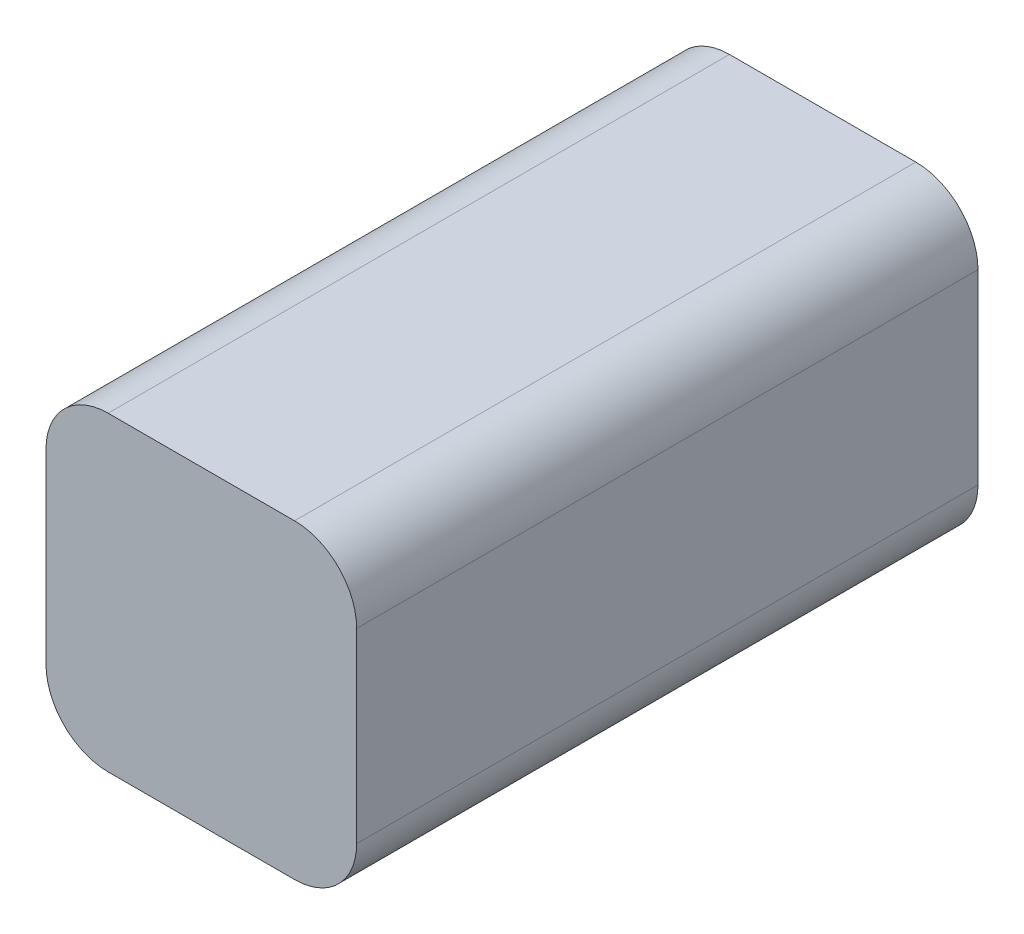
ISO-10303-21;
HEADER;
FILE_DESCRIPTION(('STEP AP214'),'2;1');
FILE_NAME('part.step','',(''),(''),'','','');
FILE_SCHEMA(('AUTOMOTIVE_DESIGN { 1 0 10303 214 1 1 1 1 }'));
ENDSEC;
DATA;
#1=APPLICATION_CONTEXT('core data for automotive mechanical design processes');
#2=APPLICATION_PROTOCOL_DEFINITION('international standard','automotive_design',2000,#1);
#3=PRODUCT_CONTEXT('',#1,'mechanical');
#4=PRODUCT('Part','Part','',(#3));
#5=PRODUCT_RELATED_PRODUCT_CATEGORY('part','',(#4));
#6=PRODUCT_DEFINITION_FORMATION('','',#4);
#7=PRODUCT_DEFINITION_CONTEXT('part definition',#1,'design');
#8=PRODUCT_DEFINITION('design','',#6,#7);
#9=PRODUCT_DEFINITION_SHAPE('','',#8);
#10=(LENGTH_UNIT() NAMED_UNIT(*) SI_UNIT(.MILLI.,.METRE.));
#11=(NAMED_UNIT(*) PLANE_ANGLE_UNIT() SI_UNIT($,.RADIAN.));
#12=(NAMED_UNIT(*) SI_UNIT($,.STERADIAN.) SOLID_ANGLE_UNIT());
#13=UNCERTAINTY_MEASURE_WITH_UNIT(LENGTH_MEASURE(1.E-05),#10,'distance_accuracy_value','');
#14=(GEOMETRIC_REPRESENTATION_CONTEXT(3) GLOBAL_UNCERTAINTY_ASSIGNED_CONTEXT((#13)) GLOBAL_UNIT_ASSIGNED_CONTEXT((#10,
#11,#12)) REPRESENTATION_CONTEXT('',''));
#15=CARTESIAN_POINT('',(0.,0.,0.));
#16=DIRECTION('',(0.,0.,1.));
#17=DIRECTION('',(1.,0.,0.));
#18=AXIS2_PLACEMENT_3D('',#15,#16,#17);
#19=CARTESIAN_POINT('',(-7.50000000000001,-7.49999999999999,50.));
#20=DIRECTION('',(0.,0.,-1.));
#21=DIRECTION('',(-1.,0.,0.));
#22=AXIS2_PLACEMENT_3D('',#19,#20,#21);
#23=CYLINDRICAL_SURFACE('',#22,5.);
#24=CARTESIAN_POINT('',(-7.50000000000001,-7.49999999999999,0.));
#25=DIRECTION('',(0.,0.,1.));
#26=DIRECTION('',(1.,0.,0.));
#27=AXIS2_PLACEMENT_3D('',#24,#25,#26);
#28=CIRCLE('',#27,5.);
#29=CARTESIAN_POINT('',(-12.5,-7.49999999999996,0.));
#30=VERTEX_POINT('',#29);
#31=CARTESIAN_POINT('',(-7.49999999999998,-12.5,0.));
#32=VERTEX_POINT('',#31);
#33=EDGE_CURVE('E141',#30,#32,#28,.T.);
#34=ORIENTED_EDGE('',*,*,#33,.T.);
#35=DIRECTION('',(0.,0.,-1.));
#36=VECTOR('',#35,1.);
#37=CARTESIAN_POINT('',(-7.49999999999998,-12.5,50.));
#38=LINE('',#37,#36);
#39=CARTESIAN_POINT('',(-7.49999999999998,-12.5,50.));
#40=VERTEX_POINT('',#39);
#41=EDGE_CURVE('E11',#40,#32,#38,.T.);
#42=ORIENTED_EDGE('',*,*,#41,.F.);
#43=CARTESIAN_POINT('',(-7.50000000000001,-7.49999999999999,50.));
#44=DIRECTION('',(0.,0.,1.));
#45=DIRECTION('',(1.,0.,0.));
#46=AXIS2_PLACEMENT_3D('',#43,#44,#45);
#47=CIRCLE('',#46,5.);
#48=CARTESIAN_POINT('',(-12.5,-7.49999999999996,50.));
#49=VERTEX_POINT('',#48);
#50=EDGE_CURVE('E157',#49,#40,#47,.T.);
#51=ORIENTED_EDGE('',*,*,#50,.F.);
#52=DIRECTION('',(0.,0.,-1.));
#53=VECTOR('',#52,1.);
#54=CARTESIAN_POINT('',(-12.5,-7.49999999999996,50.));
#55=LINE('',#54,#53);
#56=EDGE_CURVE('E137',#49,#30,#55,.T.);
#57=ORIENTED_EDGE('',*,*,#56,.T.);
#58=EDGE_LOOP('',(#34,#42,#51,#57));
#59=FACE_BOUND('',#58,.T.);
#60=ADVANCED_FACE('F33',(#59),#23,.T.);
#61=CARTESIAN_POINT('',(-7.49999999999998,-12.5,50.));
#62=DIRECTION('',(0.,1.,0.));
#63=DIRECTION('',(0.,0.,1.));
#64=AXIS2_PLACEMENT_3D('',#61,#62,#63);
#65=PLANE('',#64);
#66=DIRECTION('',(1.,0.,0.));
#67=VECTOR('',#66,1.);
#68=CARTESIAN_POINT('',(-7.49999999999998,-12.5,0.));
#69=LINE('',#68,#67);
#70=CARTESIAN_POINT('',(7.49999999999995,-12.5,0.));
#71=VERTEX_POINT('',#70);
#72=EDGE_CURVE('E144',#32,#71,#69,.T.);
#73=ORIENTED_EDGE('',*,*,#72,.T.);
#74=DIRECTION('',(0.,0.,-1.));
#75=VECTOR('',#74,1.);
#76=CARTESIAN_POINT('',(7.49999999999995,-12.5,50.));
#77=LINE('',#76,#75);
#78=CARTESIAN_POINT('',(7.49999999999995,-12.5,50.));
#79=VERTEX_POINT('',#78);
#80=EDGE_CURVE('E40',#79,#71,#77,.T.);
#81=ORIENTED_EDGE('',*,*,#80,.F.);
#82=DIRECTION('',(1.,0.,0.));
#83=VECTOR('',#82,1.);
#84=CARTESIAN_POINT('',(-7.49999999999998,-12.5,50.));
#85=LINE('',#84,#83);
#86=EDGE_CURVE('E97',#40,#79,#85,.T.);
#87=ORIENTED_EDGE('',*,*,#86,.F.);
#88=ORIENTED_EDGE('',*,*,#41,.T.);
#89=EDGE_LOOP('',(#73,#81,#87,#88));
#90=FACE_BOUND('',#89,.T.);
#91=ADVANCED_FACE('F331',(#90),#65,.F.);
#92=CARTESIAN_POINT('',(7.49999999999999,-7.49999999999999,50.));
#93=DIRECTION('',(0.,0.,-1.));
#94=DIRECTION('',(-1.,0.,0.));
#95=AXIS2_PLACEMENT_3D('',#92,#93,#94);
#96=CYLINDRICAL_SURFACE('',#95,5.);
#97=CARTESIAN_POINT('',(7.49999999999999,-7.49999999999999,0.));
#98=DIRECTION('',(0.,0.,1.));
#99=DIRECTION('',(1.,0.,0.));
#100=AXIS2_PLACEMENT_3D('',#97,#98,#99);
#101=CIRCLE('',#100,5.);
#102=CARTESIAN_POINT('',(12.5,-7.49999999999996,0.));
#103=VERTEX_POINT('',#102);
#104=EDGE_CURVE('E147',#71,#103,#101,.T.);
#105=ORIENTED_EDGE('',*,*,#104,.T.);
#106=DIRECTION('',(0.,0.,-1.));
#107=VECTOR('',#106,1.);
#108=CARTESIAN_POINT('',(12.5,-7.49999999999996,50.));
#109=LINE('',#108,#107);
#110=CARTESIAN_POINT('',(12.5,-7.49999999999996,50.));
#111=VERTEX_POINT('',#110);
#112=EDGE_CURVE('E164',#111,#103,#109,.T.);
#113=ORIENTED_EDGE('',*,*,#112,.F.);
#114=CARTESIAN_POINT('',(7.49999999999999,-7.49999999999999,50.));
#115=DIRECTION('',(0.,0.,1.));
#116=DIRECTION('',(1.,0.,0.));
#117=AXIS2_PLACEMENT_3D('',#114,#115,#116);
#118=CIRCLE('',#117,5.);
#119=EDGE_CURVE('E172',#79,#111,#118,.T.);
#120=ORIENTED_EDGE('',*,*,#119,.F.);
#121=ORIENTED_EDGE('',*,*,#80,.T.);
#122=EDGE_LOOP('',(#105,#113,#120,#121));
#123=FACE_BOUND('',#122,.T.);
#124=ADVANCED_FACE('F170',(#123),#96,.T.);
#125=CARTESIAN_POINT('',(12.5,7.49999999999997,50.));
#126=DIRECTION('',(-1.,0.,0.));
#127=DIRECTION('',(0.,-1.,0.));
#128=AXIS2_PLACEMENT_3D('',#125,#126,#127);
#129=PLANE('',#128);
#130=DIRECTION('',(0.,1.,0.));
#131=VECTOR('',#130,1.);
#132=CARTESIAN_POINT('',(12.5,7.49999999999997,0.));
#133=LINE('',#132,#131);
#134=CARTESIAN_POINT('',(12.5,7.49999999999997,0.));
#135=VERTEX_POINT('',#134);
#136=EDGE_CURVE('E149',#103,#135,#133,.T.);
#137=ORIENTED_EDGE('',*,*,#136,.T.);
#138=DIRECTION('',(0.,0.,-1.));
#139=VECTOR('',#138,1.);
#140=CARTESIAN_POINT('',(12.5,7.49999999999997,50.));
#141=LINE('',#140,#139);
#142=CARTESIAN_POINT('',(12.5,7.49999999999997,50.));
#143=VERTEX_POINT('',#142);
#144=EDGE_CURVE('E161',#143,#135,#141,.T.);
#145=ORIENTED_EDGE('',*,*,#144,.F.);
#146=DIRECTION('',(0.,1.,0.));
#147=VECTOR('',#146,1.);
#148=CARTESIAN_POINT('',(12.5,7.49999999999997,50.));
#149=LINE('',#148,#147);
#150=EDGE_CURVE('E184',#111,#143,#149,.T.);
#151=ORIENTED_EDGE('',*,*,#150,.F.);
#152=ORIENTED_EDGE('',*,*,#112,.T.);
#153=EDGE_LOOP('',(#137,#145,#151,#152));
#154=FACE_BOUND('',#153,.T.);
#155=ADVANCED_FACE('F180',(#154),#129,.F.);
#156=CARTESIAN_POINT('',(7.49999999999998,7.50000000000001,50.));
#157=DIRECTION('',(0.,0.,-1.));
#158=DIRECTION('',(-1.,0.,0.));
#159=AXIS2_PLACEMENT_3D('',#156,#157,#158);
#160=CYLINDRICAL_SURFACE('',#159,5.);
#161=CARTESIAN_POINT('',(7.49999999999998,7.50000000000001,0.));
#162=DIRECTION('',(0.,0.,1.));
#163=DIRECTION('',(-1.,0.,0.));
#164=AXIS2_PLACEMENT_3D('',#161,#162,#163);
#165=CIRCLE('',#164,5.);
#166=CARTESIAN_POINT('',(7.49999999999995,12.5,0.));
#167=VERTEX_POINT('',#166);
#168=EDGE_CURVE('E151',#135,#167,#165,.T.);
#169=ORIENTED_EDGE('',*,*,#168,.T.);
#170=DIRECTION('',(0.,0.,-1.));
#171=VECTOR('',#170,1.);
#172=CARTESIAN_POINT('',(7.49999999999995,12.5,50.));
#173=LINE('',#172,#171);
#174=CARTESIAN_POINT('',(7.49999999999995,12.5,50.));
#175=VERTEX_POINT('',#174);
#176=EDGE_CURVE('E132',#175,#167,#173,.T.);
#177=ORIENTED_EDGE('',*,*,#176,.F.);
#178=CARTESIAN_POINT('',(7.49999999999998,7.50000000000001,50.));
#179=DIRECTION('',(0.,0.,1.));
#180=DIRECTION('',(-1.,0.,0.));
#181=AXIS2_PLACEMENT_3D('',#178,#179,#180);
#182=CIRCLE('',#181,5.);
#183=EDGE_CURVE('E120',#143,#175,#182,.T.);
#184=ORIENTED_EDGE('',*,*,#183,.F.);
#185=ORIENTED_EDGE('',*,*,#144,.T.);
#186=EDGE_LOOP('',(#169,#177,#184,#185));
#187=FACE_BOUND('',#186,.T.);
#188=ADVANCED_FACE('F183',(#187),#160,.T.);
#189=CARTESIAN_POINT('',(-7.49999999999998,12.5,50.));
#190=DIRECTION('',(0.,-1.,0.));
#191=DIRECTION('',(0.,0.,-1.));
#192=AXIS2_PLACEMENT_3D('',#189,#190,#191);
#193=PLANE('',#192);
#194=DIRECTION('',(-1.,0.,0.));
#195=VECTOR('',#194,1.);
#196=CARTESIAN_POINT('',(-7.49999999999998,12.5,0.));
#197=LINE('',#196,#195);
#198=CARTESIAN_POINT('',(-7.49999999999998,12.5,0.));
#199=VERTEX_POINT('',#198);
#200=EDGE_CURVE('E129',#167,#199,#197,.T.);
#201=ORIENTED_EDGE('',*,*,#200,.T.);
#202=DIRECTION('',(0.,0.,-1.));
#203=VECTOR('',#202,1.);
#204=CARTESIAN_POINT('',(-7.49999999999998,12.5,50.));
#205=LINE('',#204,#203);
#206=CARTESIAN_POINT('',(-7.49999999999998,12.5,50.));
#207=VERTEX_POINT('',#206);
#208=EDGE_CURVE('E126',#207,#199,#205,.T.);
#209=ORIENTED_EDGE('',*,*,#208,.F.);
#210=DIRECTION('',(-1.,0.,0.));
#211=VECTOR('',#210,1.);
#212=CARTESIAN_POINT('',(-7.49999999999998,12.5,50.));
#213=LINE('',#212,#211);
#214=EDGE_CURVE('E113',#175,#207,#213,.T.);
#215=ORIENTED_EDGE('',*,*,#214,.F.);
#216=ORIENTED_EDGE('',*,*,#176,.T.);
#217=EDGE_LOOP('',(#201,#209,#215,#216));
#218=FACE_BOUND('',#217,.T.);
#219=ADVANCED_FACE('F127',(#218),#193,.F.);
#220=CARTESIAN_POINT('',(-7.50000000000002,7.50000000000001,50.));
#221=DIRECTION('',(0.,0.,-1.));
#222=DIRECTION('',(-1.,0.,0.));
#223=AXIS2_PLACEMENT_3D('',#220,#221,#222);
#224=CYLINDRICAL_SURFACE('',#223,5.);
#225=CARTESIAN_POINT('',(-7.50000000000002,7.50000000000001,0.));
#226=DIRECTION('',(0.,0.,1.));
#227=DIRECTION('',(1.,0.,0.));
#228=AXIS2_PLACEMENT_3D('',#225,#226,#227);
#229=CIRCLE('',#228,5.);
#230=CARTESIAN_POINT('',(-12.5,7.49999999999997,0.));
#231=VERTEX_POINT('',#230);
#232=EDGE_CURVE('E154',#199,#231,#229,.T.);
#233=ORIENTED_EDGE('',*,*,#232,.T.);
#234=DIRECTION('',(0.,0.,-1.));
#235=VECTOR('',#234,1.);
#236=CARTESIAN_POINT('',(-12.5,7.49999999999997,50.));
#237=LINE('',#236,#235);
#238=CARTESIAN_POINT('',(-12.5,7.49999999999997,50.));
#239=VERTEX_POINT('',#238);
#240=EDGE_CURVE('E133',#239,#231,#237,.T.);
#241=ORIENTED_EDGE('',*,*,#240,.F.);
#242=CARTESIAN_POINT('',(-7.50000000000002,7.50000000000001,50.));
#243=DIRECTION('',(0.,0.,1.));
#244=DIRECTION('',(1.,0.,0.));
#245=AXIS2_PLACEMENT_3D('',#242,#243,#244);
#246=CIRCLE('',#245,5.);
#247=EDGE_CURVE('E117',#207,#239,#246,.T.);
#248=ORIENTED_EDGE('',*,*,#247,.F.);
#249=ORIENTED_EDGE('',*,*,#208,.T.);
#250=EDGE_LOOP('',(#233,#241,#248,#249));
#251=FACE_BOUND('',#250,.T.);
#252=ADVANCED_FACE('F135',(#251),#224,.T.);
#253=CARTESIAN_POINT('',(-12.5,7.49999999999997,50.));
#254=DIRECTION('',(1.,0.,0.));
#255=DIRECTION('',(0.,1.,0.));
#256=AXIS2_PLACEMENT_3D('',#253,#254,#255);
#257=PLANE('',#256);
#258=DIRECTION('',(0.,-1.,0.));
#259=VECTOR('',#258,1.);
#260=CARTESIAN_POINT('',(-12.5,7.49999999999997,0.));
#261=LINE('',#260,#259);
#262=EDGE_CURVE('E89',#231,#30,#261,.T.);
#263=ORIENTED_EDGE('',*,*,#262,.T.);
#264=ORIENTED_EDGE('',*,*,#56,.F.);
#265=DIRECTION('',(0.,-1.,0.));
#266=VECTOR('',#265,1.);
#267=CARTESIAN_POINT('',(-12.5,7.49999999999997,50.));
#268=LINE('',#267,#266);
#269=EDGE_CURVE('E56',#239,#49,#268,.T.);
#270=ORIENTED_EDGE('',*,*,#269,.F.);
#271=ORIENTED_EDGE('',*,*,#240,.T.);
#272=EDGE_LOOP('',(#263,#264,#270,#271));
#273=FACE_BOUND('',#272,.T.);
#274=ADVANCED_FACE('F338',(#273),#257,.F.);
#275=CARTESIAN_POINT('',(-7.50000000000001,-7.49999999999999,50.));
#276=DIRECTION('',(0.,0.,1.));
#277=DIRECTION('',(1.,0.,0.));
#278=AXIS2_PLACEMENT_3D('',#275,#276,#277);
#279=PLANE('',#278);
#280=ORIENTED_EDGE('',*,*,#50,.T.);
#281=ORIENTED_EDGE('',*,*,#86,.T.);
#282=ORIENTED_EDGE('',*,*,#119,.T.);
#283=ORIENTED_EDGE('',*,*,#150,.T.);
#284=ORIENTED_EDGE('',*,*,#183,.T.);
#285=ORIENTED_EDGE('',*,*,#214,.T.);
#286=ORIENTED_EDGE('',*,*,#247,.T.);
#287=ORIENTED_EDGE('',*,*,#269,.T.);
#288=EDGE_LOOP('',(#280,#281,#282,#283,#284,#285,#286,#287));
#289=FACE_BOUND('',#288,.T.);
#290=ADVANCED_FACE('F115',(#289),#279,.T.);
#291=CARTESIAN_POINT('',(-7.50000000000001,-7.49999999999999,0.));
#292=DIRECTION('',(0.,0.,1.));
#293=DIRECTION('',(1.,0.,0.));
#294=AXIS2_PLACEMENT_3D('',#291,#292,#293);
#295=PLANE('',#294);
#296=DIRECTION('',(1.,0.,0.));
#297=VECTOR('',#296,1.);
#298=CARTESIAN_POINT('',(1.74999999999999,-3.75,0.));
#299=LINE('',#298,#297);
#300=CARTESIAN_POINT('',(-1.74999999999999,-3.75,0.));
#301=VERTEX_POINT('',#300);
#302=CARTESIAN_POINT('',(1.74999999999999,-3.75,0.));
#303=VERTEX_POINT('',#302);
#304=EDGE_CURVE('E212',#301,#303,#299,.T.);
#305=ORIENTED_EDGE('',*,*,#304,.T.);
#306=CARTESIAN_POINT('',(1.75,-1.75,0.));
#307=DIRECTION('',(0.,0.,1.));
#308=DIRECTION('',(-1.,0.,0.));
#309=AXIS2_PLACEMENT_3D('',#306,#307,#308);
#310=CIRCLE('',#309,2.);
#311=CARTESIAN_POINT('',(3.75,-1.74999999999999,0.));
#312=VERTEX_POINT('',#311);
#313=EDGE_CURVE('E47',#303,#312,#310,.T.);
#314=ORIENTED_EDGE('',*,*,#313,.T.);
#315=DIRECTION('',(0.,1.,0.));
#316=VECTOR('',#315,1.);
#317=CARTESIAN_POINT('',(3.75,1.74999999999999,0.));
#318=LINE('',#317,#316);
#319=CARTESIAN_POINT('',(3.75,1.74999999999999,0.));
#320=VERTEX_POINT('',#319);
#321=EDGE_CURVE('E231',#312,#320,#318,.T.);
#322=ORIENTED_EDGE('',*,*,#321,.T.);
#323=CARTESIAN_POINT('',(1.75,1.75,0.));
#324=DIRECTION('',(0.,0.,1.));
#325=DIRECTION('',(-1.,0.,0.));
#326=AXIS2_PLACEMENT_3D('',#323,#324,#325);
#327=CIRCLE('',#326,2.);
#328=CARTESIAN_POINT('',(1.74999999999998,3.75,0.));
#329=VERTEX_POINT('',#328);
#330=EDGE_CURVE('E228',#320,#329,#327,.T.);
#331=ORIENTED_EDGE('',*,*,#330,.T.);
#332=DIRECTION('',(-1.,0.,0.));
#333=VECTOR('',#332,1.);
#334=CARTESIAN_POINT('',(1.74999999999998,3.75,0.));
#335=LINE('',#334,#333);
#336=CARTESIAN_POINT('',(-1.74999999999999,3.75,0.));
#337=VERTEX_POINT('',#336);
#338=EDGE_CURVE('E225',#329,#337,#335,.T.);
#339=ORIENTED_EDGE('',*,*,#338,.T.);
#340=CARTESIAN_POINT('',(-1.75,1.75,0.));
#341=DIRECTION('',(0.,0.,1.));
#342=DIRECTION('',(1.,0.,0.));
#343=AXIS2_PLACEMENT_3D('',#340,#341,#342);
#344=CIRCLE('',#343,2.);
#345=CARTESIAN_POINT('',(-3.75,1.74999999999999,0.));
#346=VERTEX_POINT('',#345);
#347=EDGE_CURVE('E222',#337,#346,#344,.T.);
#348=ORIENTED_EDGE('',*,*,#347,.T.);
#349=DIRECTION('',(0.,-1.,0.));
#350=VECTOR('',#349,1.);
#351=CARTESIAN_POINT('',(-3.75,1.74999999999998,0.));
#352=LINE('',#351,#350);
#353=CARTESIAN_POINT('',(-3.75,-1.74999999999999,0.));
#354=VERTEX_POINT('',#353);
#355=EDGE_CURVE('E219',#346,#354,#352,.T.);
#356=ORIENTED_EDGE('',*,*,#355,.T.);
#357=CARTESIAN_POINT('',(-1.75,-1.75,0.));
#358=DIRECTION('',(0.,0.,1.));
#359=DIRECTION('',(-1.,0.,0.));
#360=AXIS2_PLACEMENT_3D('',#357,#358,#359);
#361=CIRCLE('',#360,2.);
#362=EDGE_CURVE('E216',#354,#301,#361,.T.);
#363=ORIENTED_EDGE('',*,*,#362,.T.);
#364=EDGE_LOOP('',(#305,#314,#322,#331,#339,#348,#356,#363));
#365=FACE_BOUND('',#364,.T.);
#366=ORIENTED_EDGE('',*,*,#33,.F.);
#367=ORIENTED_EDGE('',*,*,#262,.F.);
#368=ORIENTED_EDGE('',*,*,#232,.F.);
#369=ORIENTED_EDGE('',*,*,#200,.F.);
#370=ORIENTED_EDGE('',*,*,#168,.F.);
#371=ORIENTED_EDGE('',*,*,#136,.F.);
#372=ORIENTED_EDGE('',*,*,#104,.F.);
#373=ORIENTED_EDGE('',*,*,#72,.F.);
#374=EDGE_LOOP('',(#366,#367,#368,#369,#370,#371,#372,#373));
#375=FACE_BOUND('',#374,.T.);
#376=ADVANCED_FACE('F176',(#365,#375),#295,.F.);
#377=CARTESIAN_POINT('',(1.75,-1.75,-7.5));
#378=DIRECTION('',(0.,0.,1.));
#379=DIRECTION('',(1.,0.,0.));
#380=AXIS2_PLACEMENT_3D('',#377,#378,#379);
#381=CYLINDRICAL_SURFACE('',#380,2.);
#382=ORIENTED_EDGE('',*,*,#313,.F.);
#383=DIRECTION('',(0.,0.,1.));
#384=VECTOR('',#383,1.);
#385=CARTESIAN_POINT('',(1.74999999999999,-3.75,-7.5));
#386=LINE('',#385,#384);
#387=CARTESIAN_POINT('',(1.74999999999999,-3.75,-7.5));
#388=VERTEX_POINT('',#387);
#389=EDGE_CURVE('E145',#388,#303,#386,.T.);
#390=ORIENTED_EDGE('',*,*,#389,.F.);
#391=CARTESIAN_POINT('',(1.75,-1.75,-7.5));
#392=DIRECTION('',(0.,0.,1.));
#393=DIRECTION('',(-1.,0.,0.));
#394=AXIS2_PLACEMENT_3D('',#391,#392,#393);
#395=CIRCLE('',#394,2.);
#396=CARTESIAN_POINT('',(3.75,-1.74999999999999,-7.5));
#397=VERTEX_POINT('',#396);
#398=EDGE_CURVE('E215',#388,#397,#395,.T.);
#399=ORIENTED_EDGE('',*,*,#398,.T.);
#400=DIRECTION('',(0.,0.,1.));
#401=VECTOR('',#400,1.);
#402=CARTESIAN_POINT('',(3.75,-1.74999999999999,-7.5));
#403=LINE('',#402,#401);
#404=EDGE_CURVE('E190',#397,#312,#403,.T.);
#405=ORIENTED_EDGE('',*,*,#404,.T.);
#406=EDGE_LOOP('',(#382,#390,#399,#405));
#407=FACE_BOUND('',#406,.T.);
#408=ADVANCED_FACE('F258',(#407),#381,.T.);
#409=CARTESIAN_POINT('',(1.74999999999999,-3.75,-7.5));
#410=DIRECTION('',(0.,-1.,0.));
#411=DIRECTION('',(1.,0.,0.));
#412=AXIS2_PLACEMENT_3D('',#409,#410,#411);
#413=PLANE('',#412);
#414=ORIENTED_EDGE('',*,*,#304,.F.);
#415=DIRECTION('',(0.,0.,1.));
#416=VECTOR('',#415,1.);
#417=CARTESIAN_POINT('',(-1.74999999999999,-3.75,-7.5));
#418=LINE('',#417,#416);
#419=CARTESIAN_POINT('',(-1.74999999999999,-3.75,-7.5));
#420=VERTEX_POINT('',#419);
#421=EDGE_CURVE('E208',#420,#301,#418,.T.);
#422=ORIENTED_EDGE('',*,*,#421,.F.);
#423=DIRECTION('',(1.,0.,0.));
#424=VECTOR('',#423,1.);
#425=CARTESIAN_POINT('',(1.74999999999999,-3.75,-7.5));
#426=LINE('',#425,#424);
#427=EDGE_CURVE('E193',#420,#388,#426,.T.);
#428=ORIENTED_EDGE('',*,*,#427,.T.);
#429=ORIENTED_EDGE('',*,*,#389,.T.);
#430=EDGE_LOOP('',(#414,#422,#428,#429));
#431=FACE_BOUND('',#430,.T.);
#432=ADVANCED_FACE('F275',(#431),#413,.T.);
#433=CARTESIAN_POINT('',(-1.75,-1.75,-7.5));
#434=DIRECTION('',(0.,0.,1.));
#435=DIRECTION('',(1.,0.,0.));
#436=AXIS2_PLACEMENT_3D('',#433,#434,#435);
#437=CYLINDRICAL_SURFACE('',#436,2.);
#438=ORIENTED_EDGE('',*,*,#362,.F.);
#439=DIRECTION('',(0.,0.,1.));
#440=VECTOR('',#439,1.);
#441=CARTESIAN_POINT('',(-3.75,-1.74999999999999,-7.5));
#442=LINE('',#441,#440);
#443=CARTESIAN_POINT('',(-3.75,-1.74999999999999,-7.5));
#444=VERTEX_POINT('',#443);
#445=EDGE_CURVE('E205',#444,#354,#442,.T.);
#446=ORIENTED_EDGE('',*,*,#445,.F.);
#447=CARTESIAN_POINT('',(-1.75,-1.75,-7.5));
#448=DIRECTION('',(0.,0.,1.));
#449=DIRECTION('',(-1.,0.,0.));
#450=AXIS2_PLACEMENT_3D('',#447,#448,#449);
#451=CIRCLE('',#450,2.);
#452=EDGE_CURVE('E237',#444,#420,#451,.T.);
#453=ORIENTED_EDGE('',*,*,#452,.T.);
#454=ORIENTED_EDGE('',*,*,#421,.T.);
#455=EDGE_LOOP('',(#438,#446,#453,#454));
#456=FACE_BOUND('',#455,.T.);
#457=ADVANCED_FACE('F281',(#456),#437,.T.);
#458=CARTESIAN_POINT('',(-3.75,1.74999999999998,-7.5));
#459=DIRECTION('',(-1.,0.,0.));
#460=DIRECTION('',(0.,-1.,0.));
#461=AXIS2_PLACEMENT_3D('',#458,#459,#460);
#462=PLANE('',#461);
#463=ORIENTED_EDGE('',*,*,#355,.F.);
#464=DIRECTION('',(0.,0.,1.));
#465=VECTOR('',#464,1.);
#466=CARTESIAN_POINT('',(-3.75,1.74999999999999,-7.5));
#467=LINE('',#466,#465);
#468=CARTESIAN_POINT('',(-3.75,1.74999999999999,-7.5));
#469=VERTEX_POINT('',#468);
#470=EDGE_CURVE('E202',#469,#346,#467,.T.);
#471=ORIENTED_EDGE('',*,*,#470,.F.);
#472=DIRECTION('',(0.,-1.,0.));
#473=VECTOR('',#472,1.);
#474=CARTESIAN_POINT('',(-3.75,1.74999999999998,-7.5));
#475=LINE('',#474,#473);
#476=EDGE_CURVE('E240',#469,#444,#475,.T.);
#477=ORIENTED_EDGE('',*,*,#476,.T.);
#478=ORIENTED_EDGE('',*,*,#445,.T.);
#479=EDGE_LOOP('',(#463,#471,#477,#478));
#480=FACE_BOUND('',#479,.T.);
#481=ADVANCED_FACE('F289',(#480),#462,.T.);
#482=CARTESIAN_POINT('',(-1.75,1.75,-7.5));
#483=DIRECTION('',(0.,0.,1.));
#484=DIRECTION('',(1.,0.,0.));
#485=AXIS2_PLACEMENT_3D('',#482,#483,#484);
#486=CYLINDRICAL_SURFACE('',#485,2.);
#487=ORIENTED_EDGE('',*,*,#347,.F.);
#488=DIRECTION('',(0.,0.,1.));
#489=VECTOR('',#488,1.);
#490=CARTESIAN_POINT('',(-1.74999999999999,3.75,-7.5));
#491=LINE('',#490,#489);
#492=CARTESIAN_POINT('',(-1.74999999999999,3.75,-7.5));
#493=VERTEX_POINT('',#492);
#494=EDGE_CURVE('E199',#493,#337,#491,.T.);
#495=ORIENTED_EDGE('',*,*,#494,.F.);
#496=CARTESIAN_POINT('',(-1.75,1.75,-7.5));
#497=DIRECTION('',(0.,0.,1.));
#498=DIRECTION('',(1.,0.,0.));
#499=AXIS2_PLACEMENT_3D('',#496,#497,#498);
#500=CIRCLE('',#499,2.);
#501=EDGE_CURVE('E243',#493,#469,#500,.T.);
#502=ORIENTED_EDGE('',*,*,#501,.T.);
#503=ORIENTED_EDGE('',*,*,#470,.T.);
#504=EDGE_LOOP('',(#487,#495,#502,#503));
#505=FACE_BOUND('',#504,.T.);
#506=ADVANCED_FACE('F296',(#505),#486,.T.);
#507=CARTESIAN_POINT('',(1.74999999999998,3.75,-7.5));
#508=DIRECTION('',(0.,1.,0.));
#509=DIRECTION('',(-1.,0.,0.));
#510=AXIS2_PLACEMENT_3D('',#507,#508,#509);
#511=PLANE('',#510);
#512=ORIENTED_EDGE('',*,*,#338,.F.);
#513=DIRECTION('',(0.,0.,1.));
#514=VECTOR('',#513,1.);
#515=CARTESIAN_POINT('',(1.74999999999998,3.75,-7.5));
#516=LINE('',#515,#514);
#517=CARTESIAN_POINT('',(1.74999999999998,3.75,-7.5));
#518=VERTEX_POINT('',#517);
#519=EDGE_CURVE('E196',#518,#329,#516,.T.);
#520=ORIENTED_EDGE('',*,*,#519,.F.);
#521=DIRECTION('',(-1.,0.,0.));
#522=VECTOR('',#521,1.);
#523=CARTESIAN_POINT('',(1.74999999999998,3.75,-7.5));
#524=LINE('',#523,#522);
#525=EDGE_CURVE('E246',#518,#493,#524,.T.);
#526=ORIENTED_EDGE('',*,*,#525,.T.);
#527=ORIENTED_EDGE('',*,*,#494,.T.);
#528=EDGE_LOOP('',(#512,#520,#526,#527));
#529=FACE_BOUND('',#528,.T.);
#530=ADVANCED_FACE('F321',(#529),#511,.T.);
#531=CARTESIAN_POINT('',(1.75,1.75,-7.5));
#532=DIRECTION('',(0.,0.,1.));
#533=DIRECTION('',(1.,0.,0.));
#534=AXIS2_PLACEMENT_3D('',#531,#532,#533);
#535=CYLINDRICAL_SURFACE('',#534,2.);
#536=ORIENTED_EDGE('',*,*,#330,.F.);
#537=DIRECTION('',(0.,0.,1.));
#538=VECTOR('',#537,1.);
#539=CARTESIAN_POINT('',(3.75,1.74999999999999,-7.5));
#540=LINE('',#539,#538);
#541=CARTESIAN_POINT('',(3.75,1.74999999999999,-7.5));
#542=VERTEX_POINT('',#541);
#543=EDGE_CURVE('E192',#542,#320,#540,.T.);
#544=ORIENTED_EDGE('',*,*,#543,.F.);
#545=CARTESIAN_POINT('',(1.75,1.75,-7.5));
#546=DIRECTION('',(0.,0.,1.));
#547=DIRECTION('',(-1.,0.,0.));
#548=AXIS2_PLACEMENT_3D('',#545,#546,#547);
#549=CIRCLE('',#548,2.);
#550=EDGE_CURVE('E249',#542,#518,#549,.T.);
#551=ORIENTED_EDGE('',*,*,#550,.T.);
#552=ORIENTED_EDGE('',*,*,#519,.T.);
#553=EDGE_LOOP('',(#536,#544,#551,#552));
#554=FACE_BOUND('',#553,.T.);
#555=ADVANCED_FACE('F314',(#554),#535,.T.);
#556=CARTESIAN_POINT('',(3.75,1.74999999999999,-7.5));
#557=DIRECTION('',(1.,0.,0.));
#558=DIRECTION('',(0.,1.,0.));
#559=AXIS2_PLACEMENT_3D('',#556,#557,#558);
#560=PLANE('',#559);
#561=ORIENTED_EDGE('',*,*,#321,.F.);
#562=ORIENTED_EDGE('',*,*,#404,.F.);
#563=DIRECTION('',(0.,1.,0.));
#564=VECTOR('',#563,1.);
#565=CARTESIAN_POINT('',(3.75,1.74999999999999,-7.5));
#566=LINE('',#565,#564);
#567=EDGE_CURVE('E252',#397,#542,#566,.T.);
#568=ORIENTED_EDGE('',*,*,#567,.T.);
#569=ORIENTED_EDGE('',*,*,#543,.T.);
#570=EDGE_LOOP('',(#561,#562,#568,#569));
#571=FACE_BOUND('',#570,.T.);
#572=ADVANCED_FACE('F317',(#571),#560,.T.);
#573=CARTESIAN_POINT('',(1.75,-1.75,-7.5));
#574=DIRECTION('',(0.,0.,-1.));
#575=DIRECTION('',(-1.,0.,0.));
#576=AXIS2_PLACEMENT_3D('',#573,#574,#575);
#577=PLANE('',#576);
#578=ORIENTED_EDGE('',*,*,#398,.F.);
#579=ORIENTED_EDGE('',*,*,#427,.F.);
#580=ORIENTED_EDGE('',*,*,#452,.F.);
#581=ORIENTED_EDGE('',*,*,#476,.F.);
#582=ORIENTED_EDGE('',*,*,#501,.F.);
#583=ORIENTED_EDGE('',*,*,#525,.F.);
#584=ORIENTED_EDGE('',*,*,#550,.F.);
#585=ORIENTED_EDGE('',*,*,#567,.F.);
#586=EDGE_LOOP('',(#578,#579,#580,#581,#582,#583,#584,#585));
#587=FACE_BOUND('',#586,.T.);
#588=ADVANCED_FACE('F267',(#587),#577,.T.);
#589=CLOSED_SHELL('',(#60,#91,#124,#155,#188,#219,#252,#274,#290,#376,#408,#432,#457,#481,#506,
#530,#555,#572,#588));
#590=MANIFOLD_SOLID_BREP('B2',#589);
#591=ADVANCED_BREP_SHAPE_REPRESENTATION('',(#18,#590),#14);
#592=SHAPE_DEFINITION_REPRESENTATION(#9,#591);
ENDSEC;
END-ISO-10303-21;
